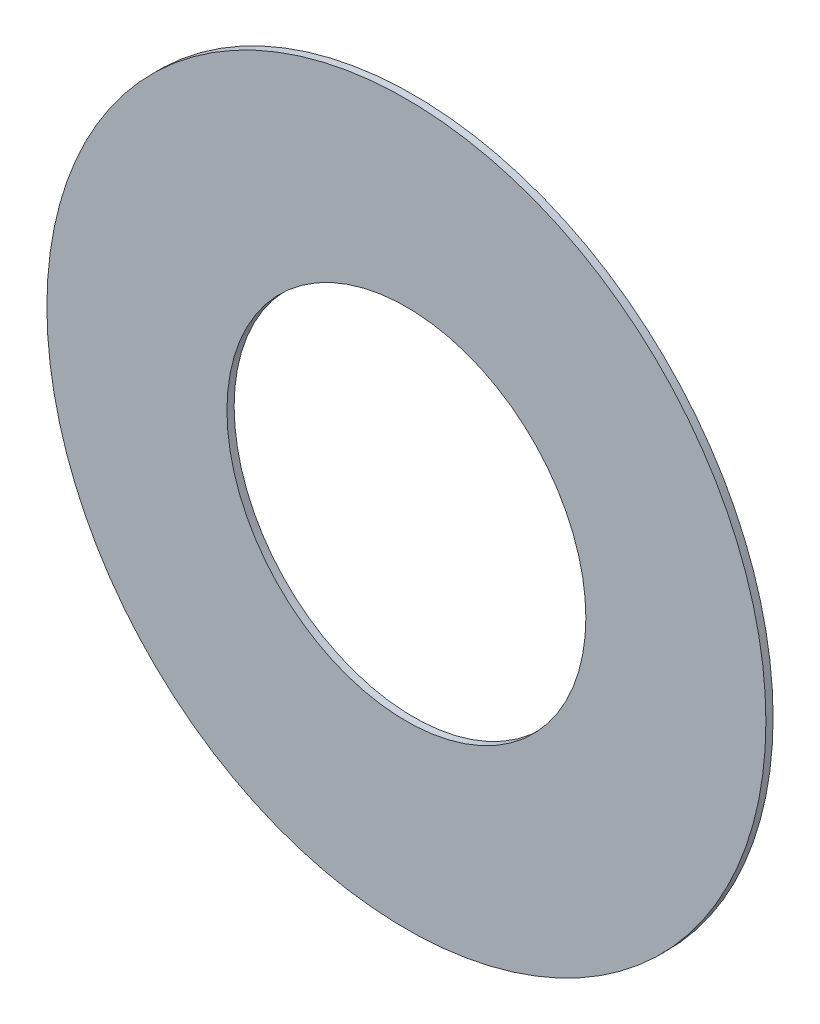
ISO-10303-21;
HEADER;
FILE_DESCRIPTION(('STEP AP214'),'2;1');
FILE_NAME('part.step','',(''),(''),'','','');
FILE_SCHEMA(('AUTOMOTIVE_DESIGN { 1 0 10303 214 1 1 1 1 }'));
ENDSEC;
DATA;
#1=APPLICATION_CONTEXT('core data for automotive mechanical design processes');
#2=APPLICATION_PROTOCOL_DEFINITION('international standard','automotive_design',2000,#1);
#3=PRODUCT_CONTEXT('',#1,'mechanical');
#4=PRODUCT('Part','Part','',(#3));
#5=PRODUCT_RELATED_PRODUCT_CATEGORY('part','',(#4));
#6=PRODUCT_DEFINITION_FORMATION('','',#4);
#7=PRODUCT_DEFINITION_CONTEXT('part definition',#1,'design');
#8=PRODUCT_DEFINITION('design','',#6,#7);
#9=PRODUCT_DEFINITION_SHAPE('','',#8);
#10=(LENGTH_UNIT() NAMED_UNIT(*) SI_UNIT(.MILLI.,.METRE.));
#11=(NAMED_UNIT(*) PLANE_ANGLE_UNIT() SI_UNIT($,.RADIAN.));
#12=(NAMED_UNIT(*) SI_UNIT($,.STERADIAN.) SOLID_ANGLE_UNIT());
#13=UNCERTAINTY_MEASURE_WITH_UNIT(LENGTH_MEASURE(1.E-05),#10,'distance_accuracy_value','');
#14=(GEOMETRIC_REPRESENTATION_CONTEXT(3) GLOBAL_UNCERTAINTY_ASSIGNED_CONTEXT((#13)) GLOBAL_UNIT_ASSIGNED_CONTEXT((#10,
#11,#12)) REPRESENTATION_CONTEXT('',''));
#15=CARTESIAN_POINT('',(0.,0.,0.));
#16=DIRECTION('',(0.,0.,1.));
#17=DIRECTION('',(1.,0.,0.));
#18=AXIS2_PLACEMENT_3D('',#15,#16,#17);
#19=CARTESIAN_POINT('',(0.,0.,1.5875));
#20=DIRECTION('',(0.,0.,1.));
#21=DIRECTION('',(1.,0.,0.));
#22=AXIS2_PLACEMENT_3D('',#19,#20,#21);
#23=PLANE('',#22);
#24=CARTESIAN_POINT('',(0.,0.,1.5875));
#25=DIRECTION('',(0.,0.,1.));
#26=DIRECTION('',(1.,0.,0.));
#27=AXIS2_PLACEMENT_3D('',#24,#25,#26);
#28=CIRCLE('',#27,79.375);
#29=CARTESIAN_POINT('',(79.375,0.,1.5875));
#30=VERTEX_POINT('',#29);
#31=EDGE_CURVE('E10',#30,#30,#28,.T.);
#32=ORIENTED_EDGE('',*,*,#31,.T.);
#33=EDGE_LOOP('',(#32));
#34=FACE_BOUND('',#33,.T.);
#35=CARTESIAN_POINT('',(0.,0.,1.5875));
#36=DIRECTION('',(0.,0.,1.));
#37=DIRECTION('',(1.,0.,0.));
#38=AXIS2_PLACEMENT_3D('',#35,#36,#37);
#39=CIRCLE('',#38,39.624);
#40=CARTESIAN_POINT('',(39.624,0.,1.5875));
#41=VERTEX_POINT('',#40);
#42=EDGE_CURVE('E46',#41,#41,#39,.T.);
#43=ORIENTED_EDGE('',*,*,#42,.F.);
#44=EDGE_LOOP('',(#43));
#45=FACE_BOUND('',#44,.T.);
#46=ADVANCED_FACE('F35',(#34,#45),#23,.T.);
#47=CARTESIAN_POINT('',(0.,0.,0.));
#48=DIRECTION('',(0.,0.,1.));
#49=DIRECTION('',(1.,0.,0.));
#50=AXIS2_PLACEMENT_3D('',#47,#48,#49);
#51=PLANE('',#50);
#52=CARTESIAN_POINT('',(0.,0.,0.));
#53=DIRECTION('',(0.,0.,1.));
#54=DIRECTION('',(1.,0.,0.));
#55=AXIS2_PLACEMENT_3D('',#52,#53,#54);
#56=CIRCLE('',#55,79.375);
#57=CARTESIAN_POINT('',(79.375,0.,0.));
#58=VERTEX_POINT('',#57);
#59=EDGE_CURVE('E39',#58,#58,#56,.T.);
#60=ORIENTED_EDGE('',*,*,#59,.F.);
#61=EDGE_LOOP('',(#60));
#62=FACE_BOUND('',#61,.T.);
#63=CARTESIAN_POINT('',(0.,0.,0.));
#64=DIRECTION('',(0.,0.,1.));
#65=DIRECTION('',(1.,0.,0.));
#66=AXIS2_PLACEMENT_3D('',#63,#64,#65);
#67=CIRCLE('',#66,39.624);
#68=CARTESIAN_POINT('',(39.624,0.,0.));
#69=VERTEX_POINT('',#68);
#70=EDGE_CURVE('E48',#69,#69,#67,.T.);
#71=ORIENTED_EDGE('',*,*,#70,.T.);
#72=EDGE_LOOP('',(#71));
#73=FACE_BOUND('',#72,.T.);
#74=ADVANCED_FACE('F58',(#62,#73),#51,.F.);
#75=CARTESIAN_POINT('',(0.,0.,1.5875));
#76=DIRECTION('',(0.,0.,-1.));
#77=DIRECTION('',(-1.,0.,0.));
#78=AXIS2_PLACEMENT_3D('',#75,#76,#77);
#79=CYLINDRICAL_SURFACE('',#78,79.375);
#80=ORIENTED_EDGE('',*,*,#31,.F.);
#81=EDGE_LOOP('',(#80));
#82=FACE_BOUND('',#81,.T.);
#83=ORIENTED_EDGE('',*,*,#59,.T.);
#84=EDGE_LOOP('',(#83));
#85=FACE_BOUND('',#84,.T.);
#86=ADVANCED_FACE('F37',(#82,#85),#79,.T.);
#87=CARTESIAN_POINT('',(0.,0.,1.5875));
#88=DIRECTION('',(0.,0.,-1.));
#89=DIRECTION('',(-1.,0.,0.));
#90=AXIS2_PLACEMENT_3D('',#87,#88,#89);
#91=CYLINDRICAL_SURFACE('',#90,39.624);
#92=ORIENTED_EDGE('',*,*,#42,.T.);
#93=EDGE_LOOP('',(#92));
#94=FACE_BOUND('',#93,.T.);
#95=ORIENTED_EDGE('',*,*,#70,.F.);
#96=EDGE_LOOP('',(#95));
#97=FACE_BOUND('',#96,.T.);
#98=ADVANCED_FACE('F54',(#94,#97),#91,.F.);
#99=CLOSED_SHELL('',(#46,#74,#86,#98));
#100=MANIFOLD_SOLID_BREP('B2',#99);
#101=ADVANCED_BREP_SHAPE_REPRESENTATION('',(#18,#100),#14);
#102=SHAPE_DEFINITION_REPRESENTATION(#9,#101);
ENDSEC;
END-ISO-10303-21;
